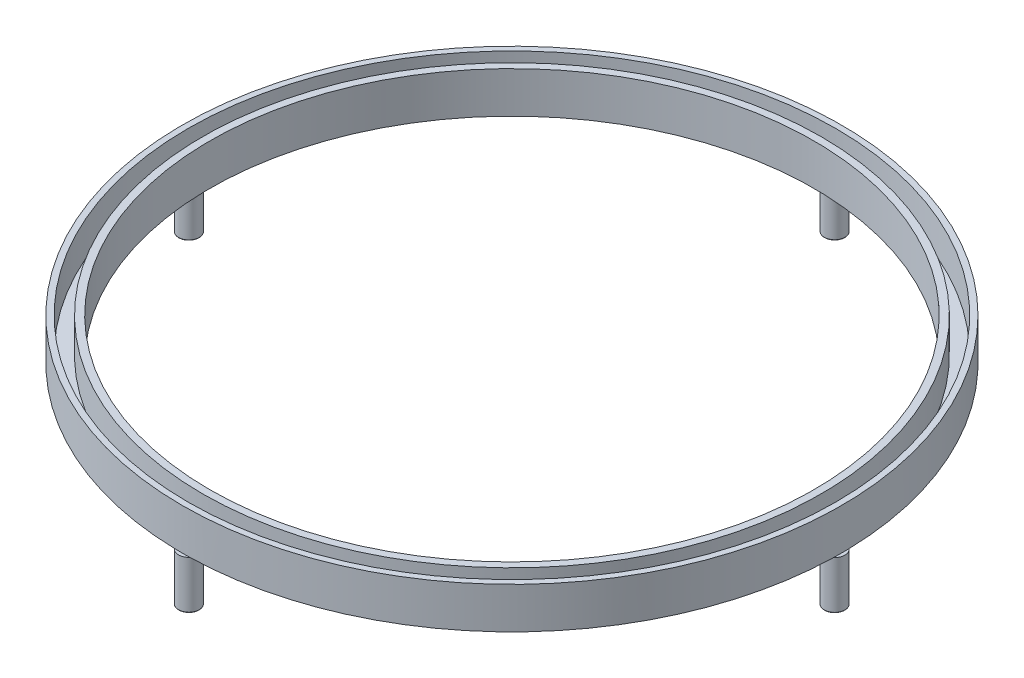
ISO-10303-21;
HEADER;
FILE_DESCRIPTION(('STEP AP214'),'2;1');
FILE_NAME('part.step','',(''),(''),'','','');
FILE_SCHEMA(('AUTOMOTIVE_DESIGN { 1 0 10303 214 1 1 1 1 }'));
ENDSEC;
DATA;
#1=APPLICATION_CONTEXT('core data for automotive mechanical design processes');
#2=APPLICATION_PROTOCOL_DEFINITION('international standard','automotive_design',2000,#1);
#3=PRODUCT_CONTEXT('',#1,'mechanical');
#4=PRODUCT('Part','Part','',(#3));
#5=PRODUCT_RELATED_PRODUCT_CATEGORY('part','',(#4));
#6=PRODUCT_DEFINITION_FORMATION('','',#4);
#7=PRODUCT_DEFINITION_CONTEXT('part definition',#1,'design');
#8=PRODUCT_DEFINITION('design','',#6,#7);
#9=PRODUCT_DEFINITION_SHAPE('','',#8);
#10=(LENGTH_UNIT() NAMED_UNIT(*) SI_UNIT(.MILLI.,.METRE.));
#11=(NAMED_UNIT(*) PLANE_ANGLE_UNIT() SI_UNIT($,.RADIAN.));
#12=(NAMED_UNIT(*) SI_UNIT($,.STERADIAN.) SOLID_ANGLE_UNIT());
#13=UNCERTAINTY_MEASURE_WITH_UNIT(LENGTH_MEASURE(1.E-05),#10,'distance_accuracy_value','');
#14=(GEOMETRIC_REPRESENTATION_CONTEXT(3) GLOBAL_UNCERTAINTY_ASSIGNED_CONTEXT((#13)) GLOBAL_UNIT_ASSIGNED_CONTEXT((#10,
#11,#12)) REPRESENTATION_CONTEXT('',''));
#15=CARTESIAN_POINT('',(0.,0.,0.));
#16=DIRECTION('',(0.,0.,1.));
#17=DIRECTION('',(1.,0.,0.));
#18=AXIS2_PLACEMENT_3D('',#15,#16,#17);
#19=CARTESIAN_POINT('',(0.,6.,0.));
#20=DIRECTION('',(0.,1.,0.));
#21=DIRECTION('',(0.,0.,1.));
#22=AXIS2_PLACEMENT_3D('',#19,#20,#21);
#23=PLANE('',#22);
#24=CARTESIAN_POINT('',(0.,6.,0.));
#25=DIRECTION('',(0.,1.,0.));
#26=DIRECTION('',(0.,0.,1.));
#27=AXIS2_PLACEMENT_3D('',#24,#25,#26);
#28=CIRCLE('',#27,44.);
#29=CARTESIAN_POINT('',(0.,6.,44.));
#30=VERTEX_POINT('',#29);
#31=EDGE_CURVE('E221',#30,#30,#28,.T.);
#32=ORIENTED_EDGE('',*,*,#31,.F.);
#33=EDGE_LOOP('',(#32));
#34=FACE_BOUND('',#33,.T.);
#35=CARTESIAN_POINT('',(0.,6.,0.));
#36=DIRECTION('',(0.,1.,0.));
#37=DIRECTION('',(0.,0.,1.));
#38=AXIS2_PLACEMENT_3D('',#35,#36,#37);
#39=CIRCLE('',#38,45.05);
#40=CARTESIAN_POINT('',(0.,6.,45.05));
#41=VERTEX_POINT('',#40);
#42=EDGE_CURVE('E120',#41,#41,#39,.F.);
#43=ORIENTED_EDGE('',*,*,#42,.F.);
#44=EDGE_LOOP('',(#43));
#45=FACE_BOUND('',#44,.T.);
#46=ADVANCED_FACE('F47',(#34,#45),#23,.T.);
#47=CARTESIAN_POINT('',(0.,6.,0.));
#48=DIRECTION('',(0.,1.,0.));
#49=DIRECTION('',(0.,0.,1.));
#50=AXIS2_PLACEMENT_3D('',#47,#48,#49);
#51=CIRCLE('',#50,47.15);
#52=CARTESIAN_POINT('',(0.,6.,47.15));
#53=VERTEX_POINT('',#52);
#54=EDGE_CURVE('E123',#53,#53,#51,.F.);
#55=ORIENTED_EDGE('',*,*,#54,.T.);
#56=EDGE_LOOP('',(#55));
#57=FACE_BOUND('',#56,.T.);
#58=CARTESIAN_POINT('',(0.,6.,0.));
#59=DIRECTION('',(0.,1.,0.));
#60=DIRECTION('',(0.,0.,1.));
#61=AXIS2_PLACEMENT_3D('',#58,#59,#60);
#62=CIRCLE('',#61,48.);
#63=CARTESIAN_POINT('',(0.,6.,48.));
#64=VERTEX_POINT('',#63);
#65=EDGE_CURVE('E93',#64,#64,#62,.T.);
#66=ORIENTED_EDGE('',*,*,#65,.T.);
#67=EDGE_LOOP('',(#66));
#68=FACE_BOUND('',#67,.T.);
#69=ADVANCED_FACE('F160',(#57,#68),#23,.T.);
#70=CARTESIAN_POINT('',(0.,0.,0.));
#71=DIRECTION('',(0.,1.,0.));
#72=DIRECTION('',(0.,0.,1.));
#73=AXIS2_PLACEMENT_3D('',#70,#71,#72);
#74=PLANE('',#73);
#75=CARTESIAN_POINT('',(0.,0.,0.));
#76=DIRECTION('',(0.,1.,0.));
#77=DIRECTION('',(0.,0.,1.));
#78=AXIS2_PLACEMENT_3D('',#75,#76,#77);
#79=CIRCLE('',#78,48.);
#80=CARTESIAN_POINT('',(-1.12978710882718,0.,-47.9867021276596));
#81=VERTEX_POINT('',#80);
#82=CARTESIAN_POINT('',(-47.9877667498985,0.,-1.08362463858108));
#83=VERTEX_POINT('',#82);
#84=EDGE_CURVE('E113',#81,#83,#79,.T.);
#85=ORIENTED_EDGE('',*,*,#84,.F.);
#86=CARTESIAN_POINT('',(0.,0.,-47.));
#87=DIRECTION('',(0.,1.,0.));
#88=DIRECTION('',(0.,0.,1.));
#89=AXIS2_PLACEMENT_3D('',#86,#87,#88);
#90=CIRCLE('',#89,1.5);
#91=CARTESIAN_POINT('',(1.1297871088272,0.,-47.9867021276596));
#92=VERTEX_POINT('',#91);
#93=EDGE_CURVE('E132',#81,#92,#90,.T.);
#94=ORIENTED_EDGE('',*,*,#93,.T.);
#95=CARTESIAN_POINT('',(47.9867021276596,0.,-1.12978710882719));
#96=VERTEX_POINT('',#95);
#97=EDGE_CURVE('E205',#96,#92,#79,.T.);
#98=ORIENTED_EDGE('',*,*,#97,.F.);
#99=CARTESIAN_POINT('',(47.,0.,0.));
#100=DIRECTION('',(0.,1.,0.));
#101=DIRECTION('',(0.,0.,1.));
#102=AXIS2_PLACEMENT_3D('',#99,#100,#101);
#103=CIRCLE('',#102,1.5);
#104=CARTESIAN_POINT('',(47.9867021276596,0.,1.1297871088272));
#105=VERTEX_POINT('',#104);
#106=EDGE_CURVE('E92',#96,#105,#103,.T.);
#107=ORIENTED_EDGE('',*,*,#106,.T.);
#108=CARTESIAN_POINT('',(1.08362463858107,0.,47.9877667498984));
#109=VERTEX_POINT('',#108);
#110=EDGE_CURVE('E115',#109,#105,#79,.T.);
#111=ORIENTED_EDGE('',*,*,#110,.F.);
#112=CARTESIAN_POINT('',(-0.0452127659574533,0.,46.9999782532481));
#113=DIRECTION('',(0.,1.,0.));
#114=DIRECTION('',(0.,0.,1.));
#115=AXIS2_PLACEMENT_3D('',#112,#113,#114);
#116=CIRCLE('',#115,1.5);
#117=CARTESIAN_POINT('',(-1.17594853357546,0.,47.985593098829));
#118=VERTEX_POINT('',#117);
#119=EDGE_CURVE('E105',#109,#118,#116,.T.);
#120=ORIENTED_EDGE('',*,*,#119,.T.);
#121=CARTESIAN_POINT('',(-47.985593098829,0.,1.17594853357544));
#122=VERTEX_POINT('',#121);
#123=EDGE_CURVE('E101',#122,#118,#79,.T.);
#124=ORIENTED_EDGE('',*,*,#123,.F.);
#125=CARTESIAN_POINT('',(-46.9999782532481,0.,0.0452127659574533));
#126=DIRECTION('',(0.,1.,0.));
#127=DIRECTION('',(0.,0.,1.));
#128=AXIS2_PLACEMENT_3D('',#125,#126,#127);
#129=CIRCLE('',#128,1.5);
#130=EDGE_CURVE('E86',#122,#83,#129,.T.);
#131=ORIENTED_EDGE('',*,*,#130,.T.);
#132=EDGE_LOOP('',(#85,#94,#98,#107,#111,#120,#124,#131));
#133=FACE_BOUND('',#132,.T.);
#134=CARTESIAN_POINT('',(0.,0.,0.));
#135=DIRECTION('',(0.,1.,0.));
#136=DIRECTION('',(0.,0.,1.));
#137=AXIS2_PLACEMENT_3D('',#134,#135,#136);
#138=CIRCLE('',#137,44.);
#139=CARTESIAN_POINT('',(0.,0.,44.));
#140=VERTEX_POINT('',#139);
#141=EDGE_CURVE('E127',#140,#140,#138,.T.);
#142=ORIENTED_EDGE('',*,*,#141,.T.);
#143=EDGE_LOOP('',(#142));
#144=FACE_BOUND('',#143,.T.);
#145=ADVANCED_FACE('F102',(#133,#144),#74,.F.);
#146=CARTESIAN_POINT('',(0.,6.,0.));
#147=DIRECTION('',(0.,-1.,0.));
#148=DIRECTION('',(0.,0.,-1.));
#149=AXIS2_PLACEMENT_3D('',#146,#147,#148);
#150=CYLINDRICAL_SURFACE('',#149,48.);
#151=ORIENTED_EDGE('',*,*,#65,.F.);
#152=EDGE_LOOP('',(#151));
#153=FACE_BOUND('',#152,.T.);
#154=ORIENTED_EDGE('',*,*,#110,.T.);
#155=EDGE_CURVE('E118',#105,#96,#79,.T.);
#156=ORIENTED_EDGE('',*,*,#155,.T.);
#157=ORIENTED_EDGE('',*,*,#97,.T.);
#158=EDGE_CURVE('E114',#92,#81,#79,.T.);
#159=ORIENTED_EDGE('',*,*,#158,.T.);
#160=ORIENTED_EDGE('',*,*,#84,.T.);
#161=EDGE_CURVE('E98',#83,#122,#79,.T.);
#162=ORIENTED_EDGE('',*,*,#161,.T.);
#163=ORIENTED_EDGE('',*,*,#123,.T.);
#164=EDGE_CURVE('E108',#118,#109,#79,.T.);
#165=ORIENTED_EDGE('',*,*,#164,.T.);
#166=EDGE_LOOP('',(#154,#156,#157,#159,#160,#162,#163,#165));
#167=FACE_BOUND('',#166,.T.);
#168=ADVANCED_FACE('F111',(#153,#167),#150,.T.);
#169=CARTESIAN_POINT('',(0.,6.,0.));
#170=DIRECTION('',(0.,-1.,0.));
#171=DIRECTION('',(0.,0.,-1.));
#172=AXIS2_PLACEMENT_3D('',#169,#170,#171);
#173=CYLINDRICAL_SURFACE('',#172,44.);
#174=ORIENTED_EDGE('',*,*,#31,.T.);
#175=EDGE_LOOP('',(#174));
#176=FACE_BOUND('',#175,.T.);
#177=ORIENTED_EDGE('',*,*,#141,.F.);
#178=EDGE_LOOP('',(#177));
#179=FACE_BOUND('',#178,.T.);
#180=ADVANCED_FACE('F171',(#176,#179),#173,.F.);
#181=CARTESIAN_POINT('',(0.,1.,0.));
#182=DIRECTION('',(0.,1.,0.));
#183=DIRECTION('',(0.,0.,1.));
#184=AXIS2_PLACEMENT_3D('',#181,#182,#183);
#185=PLANE('',#184);
#186=CARTESIAN_POINT('',(0.,1.,0.));
#187=DIRECTION('',(0.,1.,0.));
#188=DIRECTION('',(0.,0.,1.));
#189=AXIS2_PLACEMENT_3D('',#186,#187,#188);
#190=CIRCLE('',#189,47.15);
#191=CARTESIAN_POINT('',(0.,1.,47.15));
#192=VERTEX_POINT('',#191);
#193=EDGE_CURVE('E124',#192,#192,#190,.T.);
#194=ORIENTED_EDGE('',*,*,#193,.T.);
#195=EDGE_LOOP('',(#194));
#196=FACE_BOUND('',#195,.T.);
#197=CARTESIAN_POINT('',(0.,1.,0.));
#198=DIRECTION('',(0.,1.,0.));
#199=DIRECTION('',(0.,0.,1.));
#200=AXIS2_PLACEMENT_3D('',#197,#198,#199);
#201=CIRCLE('',#200,45.05);
#202=CARTESIAN_POINT('',(0.,1.,45.05));
#203=VERTEX_POINT('',#202);
#204=EDGE_CURVE('E201',#203,#203,#201,.T.);
#205=ORIENTED_EDGE('',*,*,#204,.F.);
#206=EDGE_LOOP('',(#205));
#207=FACE_BOUND('',#206,.T.);
#208=ADVANCED_FACE('F227',(#196,#207),#185,.T.);
#209=CARTESIAN_POINT('',(0.,11.,0.));
#210=DIRECTION('',(0.,-1.,0.));
#211=DIRECTION('',(0.,0.,-1.));
#212=AXIS2_PLACEMENT_3D('',#209,#210,#211);
#213=CYLINDRICAL_SURFACE('',#212,47.15);
#214=ORIENTED_EDGE('',*,*,#54,.F.);
#215=EDGE_LOOP('',(#214));
#216=FACE_BOUND('',#215,.T.);
#217=ORIENTED_EDGE('',*,*,#193,.F.);
#218=EDGE_LOOP('',(#217));
#219=FACE_BOUND('',#218,.T.);
#220=ADVANCED_FACE('F232',(#216,#219),#213,.F.);
#221=CARTESIAN_POINT('',(0.,11.,0.));
#222=DIRECTION('',(0.,-1.,0.));
#223=DIRECTION('',(0.,0.,-1.));
#224=AXIS2_PLACEMENT_3D('',#221,#222,#223);
#225=CYLINDRICAL_SURFACE('',#224,45.05);
#226=ORIENTED_EDGE('',*,*,#42,.T.);
#227=EDGE_LOOP('',(#226));
#228=FACE_BOUND('',#227,.T.);
#229=ORIENTED_EDGE('',*,*,#204,.T.);
#230=EDGE_LOOP('',(#229));
#231=FACE_BOUND('',#230,.T.);
#232=ADVANCED_FACE('F239',(#228,#231),#225,.T.);
#233=CARTESIAN_POINT('',(-46.9999782532481,0.,0.0452127659574533));
#234=DIRECTION('',(0.,1.,0.));
#235=DIRECTION('',(0.,0.,1.));
#236=AXIS2_PLACEMENT_3D('',#233,#234,#235);
#237=PLANE('',#236);
#238=ORIENTED_EDGE('',*,*,#161,.F.);
#239=EDGE_CURVE('E68',#83,#122,#129,.T.);
#240=ORIENTED_EDGE('',*,*,#239,.T.);
#241=EDGE_LOOP('',(#238,#240));
#242=FACE_BOUND('',#241,.T.);
#243=ADVANCED_FACE('F96',(#242),#237,.T.);
#244=CARTESIAN_POINT('',(-46.9999782532481,-7.,0.0452127659574533));
#245=DIRECTION('',(0.,1.,0.));
#246=DIRECTION('',(0.,0.,1.));
#247=AXIS2_PLACEMENT_3D('',#244,#245,#246);
#248=CYLINDRICAL_SURFACE('',#247,1.5);
#249=CARTESIAN_POINT('',(-46.9999782532481,-6.9,0.0452127659574533));
#250=DIRECTION('',(0.,1.,0.));
#251=DIRECTION('',(0.,0.,1.));
#252=AXIS2_PLACEMENT_3D('',#249,#250,#251);
#253=CIRCLE('',#252,1.5);
#254=CARTESIAN_POINT('',(-46.9999782532481,-6.9,1.54521276595746));
#255=VERTEX_POINT('',#254);
#256=EDGE_CURVE('E55',#255,#255,#253,.T.);
#257=ORIENTED_EDGE('',*,*,#256,.T.);
#258=EDGE_LOOP('',(#257));
#259=FACE_BOUND('',#258,.T.);
#260=ORIENTED_EDGE('',*,*,#239,.F.);
#261=ORIENTED_EDGE('',*,*,#130,.F.);
#262=EDGE_LOOP('',(#260,#261));
#263=FACE_BOUND('',#262,.T.);
#264=ADVANCED_FACE('F87',(#259,#263),#248,.T.);
#265=CARTESIAN_POINT('',(-46.9999782532481,-7.,0.0452127659574533));
#266=DIRECTION('',(0.,1.,0.));
#267=DIRECTION('',(0.,0.,1.));
#268=AXIS2_PLACEMENT_3D('',#265,#266,#267);
#269=PLANE('',#268);
#270=CARTESIAN_POINT('',(-46.9999782532481,-7.,0.0452127659574533));
#271=DIRECTION('',(0.,1.,0.));
#272=DIRECTION('',(0.,0.,1.));
#273=AXIS2_PLACEMENT_3D('',#270,#271,#272);
#274=CIRCLE('',#273,1.4);
#275=CARTESIAN_POINT('',(-46.9999782532481,-7.,1.44521276595746));
#276=VERTEX_POINT('',#275);
#277=EDGE_CURVE('E12',#276,#276,#274,.F.);
#278=ORIENTED_EDGE('',*,*,#277,.T.);
#279=EDGE_LOOP('',(#278));
#280=FACE_BOUND('',#279,.T.);
#281=ADVANCED_FACE('F246',(#280),#269,.F.);
#282=CARTESIAN_POINT('',(-0.0452127659574533,0.,46.9999782532481));
#283=DIRECTION('',(0.,1.,0.));
#284=DIRECTION('',(0.,0.,1.));
#285=AXIS2_PLACEMENT_3D('',#282,#283,#284);
#286=PLANE('',#285);
#287=ORIENTED_EDGE('',*,*,#164,.F.);
#288=EDGE_CURVE('E61',#118,#109,#116,.T.);
#289=ORIENTED_EDGE('',*,*,#288,.T.);
#290=EDGE_LOOP('',(#287,#289));
#291=FACE_BOUND('',#290,.T.);
#292=ADVANCED_FACE('F249',(#291),#286,.T.);
#293=CARTESIAN_POINT('',(-0.0452127659574533,-7.,46.9999782532481));
#294=DIRECTION('',(0.,1.,0.));
#295=DIRECTION('',(0.,0.,1.));
#296=AXIS2_PLACEMENT_3D('',#293,#294,#295);
#297=CYLINDRICAL_SURFACE('',#296,1.5);
#298=CARTESIAN_POINT('',(-0.0452127659574533,-6.9,46.9999782532481));
#299=DIRECTION('',(0.,1.,0.));
#300=DIRECTION('',(0.,0.,1.));
#301=AXIS2_PLACEMENT_3D('',#298,#299,#300);
#302=CIRCLE('',#301,1.5);
#303=CARTESIAN_POINT('',(-0.0452127659574533,-6.9,48.4999782532481));
#304=VERTEX_POINT('',#303);
#305=EDGE_CURVE('E141',#304,#304,#302,.T.);
#306=ORIENTED_EDGE('',*,*,#305,.T.);
#307=EDGE_LOOP('',(#306));
#308=FACE_BOUND('',#307,.T.);
#309=ORIENTED_EDGE('',*,*,#119,.F.);
#310=ORIENTED_EDGE('',*,*,#288,.F.);
#311=EDGE_LOOP('',(#309,#310));
#312=FACE_BOUND('',#311,.T.);
#313=ADVANCED_FACE('F258',(#308,#312),#297,.T.);
#314=CARTESIAN_POINT('',(-0.0452127659574533,-7.,46.9999782532481));
#315=DIRECTION('',(0.,1.,0.));
#316=DIRECTION('',(0.,0.,1.));
#317=AXIS2_PLACEMENT_3D('',#314,#315,#316);
#318=PLANE('',#317);
#319=CARTESIAN_POINT('',(-0.0452127659574533,-7.,46.9999782532481));
#320=DIRECTION('',(0.,1.,0.));
#321=DIRECTION('',(0.,0.,1.));
#322=AXIS2_PLACEMENT_3D('',#319,#320,#321);
#323=CIRCLE('',#322,1.4);
#324=CARTESIAN_POINT('',(-0.0452127659574533,-7.,48.3999782532481));
#325=VERTEX_POINT('',#324);
#326=EDGE_CURVE('E144',#325,#325,#323,.F.);
#327=ORIENTED_EDGE('',*,*,#326,.T.);
#328=EDGE_LOOP('',(#327));
#329=FACE_BOUND('',#328,.T.);
#330=ADVANCED_FACE('F255',(#329),#318,.F.);
#331=CARTESIAN_POINT('',(47.,0.,0.));
#332=DIRECTION('',(0.,1.,0.));
#333=DIRECTION('',(0.,0.,1.));
#334=AXIS2_PLACEMENT_3D('',#331,#332,#333);
#335=PLANE('',#334);
#336=ORIENTED_EDGE('',*,*,#155,.F.);
#337=EDGE_CURVE('E202',#105,#96,#103,.T.);
#338=ORIENTED_EDGE('',*,*,#337,.T.);
#339=EDGE_LOOP('',(#336,#338));
#340=FACE_BOUND('',#339,.T.);
#341=ADVANCED_FACE('F212',(#340),#335,.T.);
#342=CARTESIAN_POINT('',(47.,-7.,0.));
#343=DIRECTION('',(0.,1.,0.));
#344=DIRECTION('',(0.,0.,1.));
#345=AXIS2_PLACEMENT_3D('',#342,#343,#344);
#346=CYLINDRICAL_SURFACE('',#345,1.5);
#347=CARTESIAN_POINT('',(47.,-6.9,0.));
#348=DIRECTION('',(0.,1.,0.));
#349=DIRECTION('',(0.,0.,1.));
#350=AXIS2_PLACEMENT_3D('',#347,#348,#349);
#351=CIRCLE('',#350,1.5);
#352=CARTESIAN_POINT('',(47.,-6.9,1.5));
#353=VERTEX_POINT('',#352);
#354=EDGE_CURVE('E128',#353,#353,#351,.T.);
#355=ORIENTED_EDGE('',*,*,#354,.T.);
#356=EDGE_LOOP('',(#355));
#357=FACE_BOUND('',#356,.T.);
#358=ORIENTED_EDGE('',*,*,#337,.F.);
#359=ORIENTED_EDGE('',*,*,#106,.F.);
#360=EDGE_LOOP('',(#358,#359));
#361=FACE_BOUND('',#360,.T.);
#362=ADVANCED_FACE('F269',(#357,#361),#346,.T.);
#363=CARTESIAN_POINT('',(47.,-7.,0.));
#364=DIRECTION('',(0.,1.,0.));
#365=DIRECTION('',(0.,0.,1.));
#366=AXIS2_PLACEMENT_3D('',#363,#364,#365);
#367=PLANE('',#366);
#368=CARTESIAN_POINT('',(47.,-7.,0.));
#369=DIRECTION('',(0.,1.,0.));
#370=DIRECTION('',(0.,0.,1.));
#371=AXIS2_PLACEMENT_3D('',#368,#369,#370);
#372=CIRCLE('',#371,1.4);
#373=CARTESIAN_POINT('',(47.,-7.,1.4));
#374=VERTEX_POINT('',#373);
#375=EDGE_CURVE('E131',#374,#374,#372,.F.);
#376=ORIENTED_EDGE('',*,*,#375,.T.);
#377=EDGE_LOOP('',(#376));
#378=FACE_BOUND('',#377,.T.);
#379=ADVANCED_FACE('F266',(#378),#367,.F.);
#380=CARTESIAN_POINT('',(0.,0.,-47.));
#381=DIRECTION('',(0.,1.,0.));
#382=DIRECTION('',(0.,0.,1.));
#383=AXIS2_PLACEMENT_3D('',#380,#381,#382);
#384=PLANE('',#383);
#385=ORIENTED_EDGE('',*,*,#158,.F.);
#386=EDGE_CURVE('E197',#92,#81,#90,.T.);
#387=ORIENTED_EDGE('',*,*,#386,.T.);
#388=EDGE_LOOP('',(#385,#387));
#389=FACE_BOUND('',#388,.T.);
#390=ADVANCED_FACE('F194',(#389),#384,.T.);
#391=CARTESIAN_POINT('',(0.,-7.,-47.));
#392=DIRECTION('',(0.,1.,0.));
#393=DIRECTION('',(0.,0.,1.));
#394=AXIS2_PLACEMENT_3D('',#391,#392,#393);
#395=CYLINDRICAL_SURFACE('',#394,1.5);
#396=CARTESIAN_POINT('',(0.,-6.9,-47.));
#397=DIRECTION('',(0.,1.,0.));
#398=DIRECTION('',(0.,0.,1.));
#399=AXIS2_PLACEMENT_3D('',#396,#397,#398);
#400=CIRCLE('',#399,1.5);
#401=CARTESIAN_POINT('',(0.,-6.9,-45.5));
#402=VERTEX_POINT('',#401);
#403=EDGE_CURVE('E135',#402,#402,#400,.T.);
#404=ORIENTED_EDGE('',*,*,#403,.T.);
#405=EDGE_LOOP('',(#404));
#406=FACE_BOUND('',#405,.T.);
#407=ORIENTED_EDGE('',*,*,#386,.F.);
#408=ORIENTED_EDGE('',*,*,#93,.F.);
#409=EDGE_LOOP('',(#407,#408));
#410=FACE_BOUND('',#409,.T.);
#411=ADVANCED_FACE('F191',(#406,#410),#395,.T.);
#412=CARTESIAN_POINT('',(0.,-7.,-47.));
#413=DIRECTION('',(0.,1.,0.));
#414=DIRECTION('',(0.,0.,1.));
#415=AXIS2_PLACEMENT_3D('',#412,#413,#414);
#416=PLANE('',#415);
#417=CARTESIAN_POINT('',(0.,-7.,-47.));
#418=DIRECTION('',(0.,1.,0.));
#419=DIRECTION('',(0.,0.,1.));
#420=AXIS2_PLACEMENT_3D('',#417,#418,#419);
#421=CIRCLE('',#420,1.4);
#422=CARTESIAN_POINT('',(0.,-7.,-45.6));
#423=VERTEX_POINT('',#422);
#424=EDGE_CURVE('E138',#423,#423,#421,.F.);
#425=ORIENTED_EDGE('',*,*,#424,.T.);
#426=EDGE_LOOP('',(#425));
#427=FACE_BOUND('',#426,.T.);
#428=ADVANCED_FACE('F181',(#427),#416,.F.);
#429=CARTESIAN_POINT('',(47.,-6.9,0.));
#430=DIRECTION('',(0.,1.,0.));
#431=DIRECTION('',(0.,0.,1.));
#432=AXIS2_PLACEMENT_3D('',#429,#430,#431);
#433=TOROIDAL_SURFACE('',#432,1.4,0.1);
#434=ORIENTED_EDGE('',*,*,#375,.F.);
#435=EDGE_LOOP('',(#434));
#436=FACE_BOUND('',#435,.T.);
#437=ORIENTED_EDGE('',*,*,#354,.F.);
#438=EDGE_LOOP('',(#437));
#439=FACE_BOUND('',#438,.T.);
#440=ADVANCED_FACE('F178',(#436,#439),#433,.T.);
#441=CARTESIAN_POINT('',(0.,-6.9,-47.));
#442=DIRECTION('',(0.,1.,0.));
#443=DIRECTION('',(0.,0.,1.));
#444=AXIS2_PLACEMENT_3D('',#441,#442,#443);
#445=TOROIDAL_SURFACE('',#444,1.4,0.1);
#446=ORIENTED_EDGE('',*,*,#424,.F.);
#447=EDGE_LOOP('',(#446));
#448=FACE_BOUND('',#447,.T.);
#449=ORIENTED_EDGE('',*,*,#403,.F.);
#450=EDGE_LOOP('',(#449));
#451=FACE_BOUND('',#450,.T.);
#452=ADVANCED_FACE('F156',(#448,#451),#445,.T.);
#453=CARTESIAN_POINT('',(-0.0452127659574533,-6.9,46.9999782532481));
#454=DIRECTION('',(0.,1.,0.));
#455=DIRECTION('',(0.,0.,1.));
#456=AXIS2_PLACEMENT_3D('',#453,#454,#455);
#457=TOROIDAL_SURFACE('',#456,1.4,0.1);
#458=ORIENTED_EDGE('',*,*,#326,.F.);
#459=EDGE_LOOP('',(#458));
#460=FACE_BOUND('',#459,.T.);
#461=ORIENTED_EDGE('',*,*,#305,.F.);
#462=EDGE_LOOP('',(#461));
#463=FACE_BOUND('',#462,.T.);
#464=ADVANCED_FACE('F151',(#460,#463),#457,.T.);
#465=CARTESIAN_POINT('',(-46.9999782532481,-6.9,0.0452127659574533));
#466=DIRECTION('',(0.,1.,0.));
#467=DIRECTION('',(0.,0.,1.));
#468=AXIS2_PLACEMENT_3D('',#465,#466,#467);
#469=TOROIDAL_SURFACE('',#468,1.4,0.1);
#470=ORIENTED_EDGE('',*,*,#277,.F.);
#471=EDGE_LOOP('',(#470));
#472=FACE_BOUND('',#471,.T.);
#473=ORIENTED_EDGE('',*,*,#256,.F.);
#474=EDGE_LOOP('',(#473));
#475=FACE_BOUND('',#474,.T.);
#476=ADVANCED_FACE('F49',(#472,#475),#469,.T.);
#477=CLOSED_SHELL('',(#46,#69,#145,#168,#180,#208,#220,#232,#243,#264,#281,#292,#313,#330,#341,
#362,#379,#390,#411,#428,#440,#452,#464,#476));
#478=MANIFOLD_SOLID_BREP('B2',#477);
#479=ADVANCED_BREP_SHAPE_REPRESENTATION('',(#18,#478),#14);
#480=SHAPE_DEFINITION_REPRESENTATION(#9,#479);
ENDSEC;
END-ISO-10303-21;
